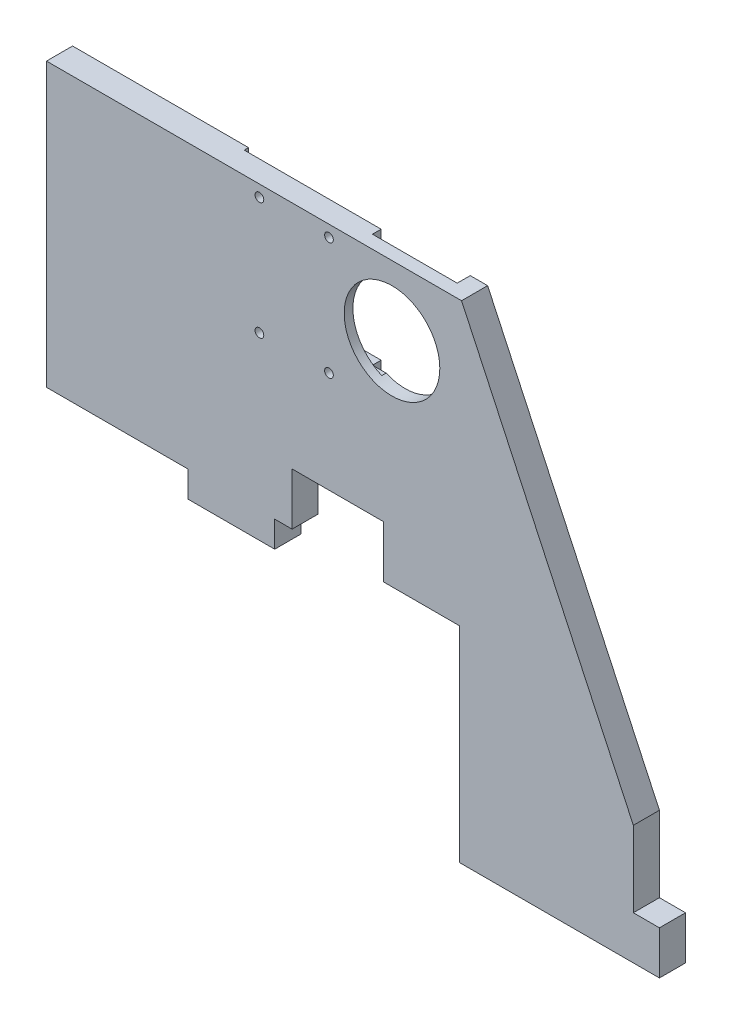
ISO-10303-21;
HEADER;
FILE_DESCRIPTION(('STEP AP214'),'2;1');
FILE_NAME('part.step','',(''),(''),'','','');
FILE_SCHEMA(('AUTOMOTIVE_DESIGN { 1 0 10303 214 1 1 1 1 }'));
ENDSEC;
DATA;
#1=APPLICATION_CONTEXT('core data for automotive mechanical design processes');
#2=APPLICATION_PROTOCOL_DEFINITION('international standard','automotive_design',2000,#1);
#3=PRODUCT_CONTEXT('',#1,'mechanical');
#4=PRODUCT('Part','Part','',(#3));
#5=PRODUCT_RELATED_PRODUCT_CATEGORY('part','',(#4));
#6=PRODUCT_DEFINITION_FORMATION('','',#4);
#7=PRODUCT_DEFINITION_CONTEXT('part definition',#1,'design');
#8=PRODUCT_DEFINITION('design','',#6,#7);
#9=PRODUCT_DEFINITION_SHAPE('','',#8);
#10=(LENGTH_UNIT() NAMED_UNIT(*) SI_UNIT(.MILLI.,.METRE.));
#11=(NAMED_UNIT(*) PLANE_ANGLE_UNIT() SI_UNIT($,.RADIAN.));
#12=(NAMED_UNIT(*) SI_UNIT($,.STERADIAN.) SOLID_ANGLE_UNIT());
#13=UNCERTAINTY_MEASURE_WITH_UNIT(LENGTH_MEASURE(1.E-05),#10,'distance_accuracy_value','');
#14=(GEOMETRIC_REPRESENTATION_CONTEXT(3) GLOBAL_UNCERTAINTY_ASSIGNED_CONTEXT((#13)) GLOBAL_UNIT_ASSIGNED_CONTEXT((#10,
#11,#12)) REPRESENTATION_CONTEXT('',''));
#15=CARTESIAN_POINT('',(0.,0.,0.));
#16=DIRECTION('',(0.,0.,1.));
#17=DIRECTION('',(1.,0.,0.));
#18=AXIS2_PLACEMENT_3D('',#15,#16,#17);
#19=CARTESIAN_POINT('',(0.,0.,6.));
#20=DIRECTION('',(0.,0.,1.));
#21=DIRECTION('',(1.,0.,0.));
#22=AXIS2_PLACEMENT_3D('',#19,#20,#21);
#23=PLANE('',#22);
#24=CARTESIAN_POINT('',(-18.5195740286363,26.435,6.));
#25=DIRECTION('',(0.,0.,1.));
#26=DIRECTION('',(1.,0.,0.));
#27=AXIS2_PLACEMENT_3D('',#24,#25,#26);
#28=CIRCLE('',#27,1.);
#29=CARTESIAN_POINT('',(-17.5195740286363,26.435,6.));
#30=VERTEX_POINT('',#29);
#31=EDGE_CURVE('E264',#30,#30,#28,.T.);
#32=ORIENTED_EDGE('',*,*,#31,.F.);
#33=EDGE_LOOP('',(#32));
#34=FACE_BOUND('',#33,.T.);
#35=CARTESIAN_POINT('',(-2.5195740286363,26.435,6.));
#36=DIRECTION('',(0.,0.,1.));
#37=DIRECTION('',(1.,0.,0.));
#38=AXIS2_PLACEMENT_3D('',#35,#36,#37);
#39=CIRCLE('',#38,1.);
#40=CARTESIAN_POINT('',(-1.5195740286363,26.435,6.));
#41=VERTEX_POINT('',#40);
#42=EDGE_CURVE('E270',#41,#41,#39,.T.);
#43=ORIENTED_EDGE('',*,*,#42,.F.);
#44=EDGE_LOOP('',(#43));
#45=FACE_BOUND('',#44,.T.);
#46=CARTESIAN_POINT('',(-18.5195740286363,53.435,6.));
#47=DIRECTION('',(0.,0.,1.));
#48=DIRECTION('',(1.,0.,0.));
#49=AXIS2_PLACEMENT_3D('',#46,#47,#48);
#50=CIRCLE('',#49,1.);
#51=CARTESIAN_POINT('',(-17.5195740286363,53.435,6.));
#52=VERTEX_POINT('',#51);
#53=EDGE_CURVE('E276',#52,#52,#50,.T.);
#54=ORIENTED_EDGE('',*,*,#53,.F.);
#55=EDGE_LOOP('',(#54));
#56=FACE_BOUND('',#55,.T.);
#57=CARTESIAN_POINT('',(-2.5195740286363,53.435,6.));
#58=DIRECTION('',(0.,0.,1.));
#59=DIRECTION('',(1.,0.,0.));
#60=AXIS2_PLACEMENT_3D('',#57,#58,#59);
#61=CIRCLE('',#60,1.);
#62=CARTESIAN_POINT('',(-1.5195740286363,53.435,6.));
#63=VERTEX_POINT('',#62);
#64=EDGE_CURVE('E282',#63,#63,#61,.T.);
#65=ORIENTED_EDGE('',*,*,#64,.F.);
#66=EDGE_LOOP('',(#65));
#67=FACE_BOUND('',#66,.T.);
#68=CARTESIAN_POINT('',(11.9804259713637,40.085,6.));
#69=DIRECTION('',(0.,0.,1.));
#70=DIRECTION('',(1.,0.,0.));
#71=AXIS2_PLACEMENT_3D('',#68,#69,#70);
#72=CIRCLE('',#71,11.);
#73=CARTESIAN_POINT('',(22.9804259713637,40.085,6.));
#74=VERTEX_POINT('',#73);
#75=EDGE_CURVE('E336',#74,#74,#72,.T.);
#76=ORIENTED_EDGE('',*,*,#75,.F.);
#77=EDGE_LOOP('',(#76));
#78=FACE_BOUND('',#77,.T.);
#79=DIRECTION('',(-1.,0.,0.));
#80=VECTOR('',#79,1.);
#81=CARTESIAN_POINT('',(-38.5,-8.91500000000001,6.));
#82=LINE('',#81,#80);
#83=CARTESIAN_POINT('',(-11.,-8.915,6.));
#84=VERTEX_POINT('',#83);
#85=CARTESIAN_POINT('',(-15.,-8.91500000000001,6.));
#86=VERTEX_POINT('',#85);
#87=EDGE_CURVE('E537',#84,#86,#82,.T.);
#88=ORIENTED_EDGE('',*,*,#87,.F.);
#89=DIRECTION('',(0.,1.,0.));
#90=VECTOR('',#89,1.);
#91=CARTESIAN_POINT('',(-11.,-8.915,6.));
#92=LINE('',#91,#90);
#93=CARTESIAN_POINT('',(-11.,3.085,6.));
#94=VERTEX_POINT('',#93);
#95=EDGE_CURVE('E247',#84,#94,#92,.T.);
#96=ORIENTED_EDGE('',*,*,#95,.T.);
#97=DIRECTION('',(1.,0.,0.));
#98=VECTOR('',#97,1.);
#99=CARTESIAN_POINT('',(-11.,3.085,6.));
#100=LINE('',#99,#98);
#101=CARTESIAN_POINT('',(10.,3.085,6.));
#102=VERTEX_POINT('',#101);
#103=EDGE_CURVE('E250',#94,#102,#100,.T.);
#104=ORIENTED_EDGE('',*,*,#103,.T.);
#105=DIRECTION('',(0.,1.,0.));
#106=VECTOR('',#105,1.);
#107=CARTESIAN_POINT('',(10.,-8.915,6.));
#108=LINE('',#107,#106);
#109=CARTESIAN_POINT('',(10.,-8.915,6.));
#110=VERTEX_POINT('',#109);
#111=EDGE_CURVE('E238',#110,#102,#108,.T.);
#112=ORIENTED_EDGE('',*,*,#111,.F.);
#113=CARTESIAN_POINT('',(27.5,-8.915,6.));
#114=VERTEX_POINT('',#113);
#115=EDGE_CURVE('E533',#114,#110,#82,.T.);
#116=ORIENTED_EDGE('',*,*,#115,.F.);
#117=DIRECTION('',(0.,1.,0.));
#118=VECTOR('',#117,1.);
#119=CARTESIAN_POINT('',(27.5,-56.085,6.));
#120=LINE('',#119,#118);
#121=CARTESIAN_POINT('',(27.5,-56.085,6.));
#122=VERTEX_POINT('',#121);
#123=EDGE_CURVE('E524',#122,#114,#120,.T.);
#124=ORIENTED_EDGE('',*,*,#123,.F.);
#125=DIRECTION('',(1.,0.,0.));
#126=VECTOR('',#125,1.);
#127=CARTESIAN_POINT('',(-67.5,-56.085,6.));
#128=LINE('',#127,#126);
#129=CARTESIAN_POINT('',(73.5,-56.085,6.));
#130=VERTEX_POINT('',#129);
#131=EDGE_CURVE('E499',#122,#130,#128,.T.);
#132=ORIENTED_EDGE('',*,*,#131,.T.);
#133=DIRECTION('',(0.,1.,0.));
#134=VECTOR('',#133,1.);
#135=CARTESIAN_POINT('',(73.5,-56.085,6.));
#136=LINE('',#135,#134);
#137=CARTESIAN_POINT('',(73.5,-46.085,6.));
#138=VERTEX_POINT('',#137);
#139=EDGE_CURVE('E386',#130,#138,#136,.T.);
#140=ORIENTED_EDGE('',*,*,#139,.T.);
#141=DIRECTION('',(-1.,0.,0.));
#142=VECTOR('',#141,1.);
#143=CARTESIAN_POINT('',(67.5,-46.085,6.));
#144=LINE('',#143,#142);
#145=CARTESIAN_POINT('',(67.5,-46.085,6.));
#146=VERTEX_POINT('',#145);
#147=EDGE_CURVE('E397',#138,#146,#144,.T.);
#148=ORIENTED_EDGE('',*,*,#147,.T.);
#149=DIRECTION('',(0.,1.,0.));
#150=VECTOR('',#149,1.);
#151=CARTESIAN_POINT('',(67.5,56.085,6.));
#152=LINE('',#151,#150);
#153=CARTESIAN_POINT('',(67.5,-28.665,6.));
#154=VERTEX_POINT('',#153);
#155=EDGE_CURVE('E410',#146,#154,#152,.T.);
#156=ORIENTED_EDGE('',*,*,#155,.T.);
#157=DIRECTION('',(0.422618261740701,-0.906307787036649,0.));
#158=VECTOR('',#157,1.);
#159=CARTESIAN_POINT('',(67.5,-28.665,6.));
#160=LINE('',#159,#158);
#161=CARTESIAN_POINT('',(27.9804259713637,56.085,6.));
#162=VERTEX_POINT('',#161);
#163=EDGE_CURVE('E409',#162,#154,#160,.T.);
#164=ORIENTED_EDGE('',*,*,#163,.F.);
#165=DIRECTION('',(-1.,0.,0.));
#166=VECTOR('',#165,1.);
#167=CARTESIAN_POINT('',(-67.5,56.085,6.));
#168=LINE('',#167,#166);
#169=CARTESIAN_POINT('',(-67.5,56.085,6.));
#170=VERTEX_POINT('',#169);
#171=EDGE_CURVE('E491',#162,#170,#168,.T.);
#172=ORIENTED_EDGE('',*,*,#171,.T.);
#173=DIRECTION('',(0.,-1.,0.));
#174=VECTOR('',#173,1.);
#175=CARTESIAN_POINT('',(-67.5,56.085,6.));
#176=LINE('',#175,#174);
#177=CARTESIAN_POINT('',(-67.5,-8.91500000000001,6.));
#178=VERTEX_POINT('',#177);
#179=EDGE_CURVE('E485',#170,#178,#176,.T.);
#180=ORIENTED_EDGE('',*,*,#179,.T.);
#181=CARTESIAN_POINT('',(-35.,-8.915,6.));
#182=VERTEX_POINT('',#181);
#183=EDGE_CURVE('E538',#182,#178,#82,.T.);
#184=ORIENTED_EDGE('',*,*,#183,.F.);
#185=DIRECTION('',(0.,-1.,0.));
#186=VECTOR('',#185,1.);
#187=CARTESIAN_POINT('',(-35.,-8.915,6.));
#188=LINE('',#187,#186);
#189=CARTESIAN_POINT('',(-35.,-14.915,6.));
#190=VERTEX_POINT('',#189);
#191=EDGE_CURVE('E358',#182,#190,#188,.T.);
#192=ORIENTED_EDGE('',*,*,#191,.T.);
#193=DIRECTION('',(1.,0.,0.));
#194=VECTOR('',#193,1.);
#195=CARTESIAN_POINT('',(-35.,-14.915,6.));
#196=LINE('',#195,#194);
#197=CARTESIAN_POINT('',(-15.,-14.915,6.));
#198=VERTEX_POINT('',#197);
#199=EDGE_CURVE('E378',#190,#198,#196,.T.);
#200=ORIENTED_EDGE('',*,*,#199,.T.);
#201=DIRECTION('',(0.,1.,0.));
#202=VECTOR('',#201,1.);
#203=CARTESIAN_POINT('',(-15.,-8.915,6.));
#204=LINE('',#203,#202);
#205=EDGE_CURVE('E369',#198,#86,#204,.T.);
#206=ORIENTED_EDGE('',*,*,#205,.T.);
#207=EDGE_LOOP('',(#88,#96,#104,#112,#116,#124,#132,#140,#148,#156,#164,#172,#180,#184,#192,
#200,#206));
#208=FACE_BOUND('',#207,.T.);
#209=ADVANCED_FACE('F33',(#34,#45,#56,#67,#78,#208),#23,.T.);
#210=CARTESIAN_POINT('',(0.,0.,0.));
#211=DIRECTION('',(0.,0.,1.));
#212=DIRECTION('',(1.,0.,0.));
#213=AXIS2_PLACEMENT_3D('',#210,#211,#212);
#214=PLANE('',#213);
#215=DIRECTION('',(0.,1.,0.));
#216=VECTOR('',#215,1.);
#217=CARTESIAN_POINT('',(-11.,-8.915,0.));
#218=LINE('',#217,#216);
#219=CARTESIAN_POINT('',(-11.,-8.915,0.));
#220=VERTEX_POINT('',#219);
#221=CARTESIAN_POINT('',(-11.,3.085,0.));
#222=VERTEX_POINT('',#221);
#223=EDGE_CURVE('E234',#220,#222,#218,.T.);
#224=ORIENTED_EDGE('',*,*,#223,.F.);
#225=DIRECTION('',(-1.,0.,0.));
#226=VECTOR('',#225,1.);
#227=CARTESIAN_POINT('',(-38.5,-8.91500000000001,0.));
#228=LINE('',#227,#226);
#229=CARTESIAN_POINT('',(-15.,-8.91500000000001,0.));
#230=VERTEX_POINT('',#229);
#231=EDGE_CURVE('E542',#220,#230,#228,.T.);
#232=ORIENTED_EDGE('',*,*,#231,.T.);
#233=DIRECTION('',(0.,1.,0.));
#234=VECTOR('',#233,1.);
#235=CARTESIAN_POINT('',(-15.,-8.915,0.));
#236=LINE('',#235,#234);
#237=CARTESIAN_POINT('',(-15.,-14.915,0.));
#238=VERTEX_POINT('',#237);
#239=EDGE_CURVE('E372',#238,#230,#236,.T.);
#240=ORIENTED_EDGE('',*,*,#239,.F.);
#241=DIRECTION('',(1.,0.,0.));
#242=VECTOR('',#241,1.);
#243=CARTESIAN_POINT('',(-35.,-14.915,0.));
#244=LINE('',#243,#242);
#245=CARTESIAN_POINT('',(-35.,-14.915,0.));
#246=VERTEX_POINT('',#245);
#247=EDGE_CURVE('E368',#246,#238,#244,.T.);
#248=ORIENTED_EDGE('',*,*,#247,.F.);
#249=DIRECTION('',(0.,-1.,0.));
#250=VECTOR('',#249,1.);
#251=CARTESIAN_POINT('',(-35.,-8.915,0.));
#252=LINE('',#251,#250);
#253=CARTESIAN_POINT('',(-35.,-8.91500000000001,0.));
#254=VERTEX_POINT('',#253);
#255=EDGE_CURVE('E365',#254,#246,#252,.T.);
#256=ORIENTED_EDGE('',*,*,#255,.F.);
#257=CARTESIAN_POINT('',(-67.5,-8.91500000000001,0.));
#258=VERTEX_POINT('',#257);
#259=EDGE_CURVE('E543',#254,#258,#228,.T.);
#260=ORIENTED_EDGE('',*,*,#259,.T.);
#261=DIRECTION('',(0.,-1.,0.));
#262=VECTOR('',#261,1.);
#263=CARTESIAN_POINT('',(-67.5,56.085,0.));
#264=LINE('',#263,#262);
#265=CARTESIAN_POINT('',(-67.5,56.085,0.));
#266=VERTEX_POINT('',#265);
#267=EDGE_CURVE('E482',#266,#258,#264,.T.);
#268=ORIENTED_EDGE('',*,*,#267,.F.);
#269=DIRECTION('',(-1.,0.,0.));
#270=VECTOR('',#269,1.);
#271=CARTESIAN_POINT('',(-67.5,56.085,0.));
#272=LINE('',#271,#270);
#273=CARTESIAN_POINT('',(-27.0195740286363,56.085,0.));
#274=VERTEX_POINT('',#273);
#275=EDGE_CURVE('E459',#274,#266,#272,.T.);
#276=ORIENTED_EDGE('',*,*,#275,.F.);
#277=DIRECTION('',(0.,1.,0.));
#278=VECTOR('',#277,1.);
#279=CARTESIAN_POINT('',(-27.0195740286363,56.085,0.));
#280=LINE('',#279,#278);
#281=CARTESIAN_POINT('',(-27.0195740286363,24.085,0.));
#282=VERTEX_POINT('',#281);
#283=EDGE_CURVE('E344',#282,#274,#280,.T.);
#284=ORIENTED_EDGE('',*,*,#283,.F.);
#285=DIRECTION('',(-1.,0.,0.));
#286=VECTOR('',#285,1.);
#287=CARTESIAN_POINT('',(23.9804259713637,24.085,0.));
#288=LINE('',#287,#286);
#289=CARTESIAN_POINT('',(23.9804259713637,24.085,0.));
#290=VERTEX_POINT('',#289);
#291=EDGE_CURVE('E351',#290,#282,#288,.T.);
#292=ORIENTED_EDGE('',*,*,#291,.F.);
#293=DIRECTION('',(0.,-1.,0.));
#294=VECTOR('',#293,1.);
#295=CARTESIAN_POINT('',(23.9804259713637,56.085,0.));
#296=LINE('',#295,#294);
#297=CARTESIAN_POINT('',(23.9804259713637,56.085,0.));
#298=VERTEX_POINT('',#297);
#299=EDGE_CURVE('E339',#298,#290,#296,.T.);
#300=ORIENTED_EDGE('',*,*,#299,.F.);
#301=CARTESIAN_POINT('',(27.9804259713637,56.085,0.));
#302=VERTEX_POINT('',#301);
#303=EDGE_CURVE('E474',#302,#298,#272,.T.);
#304=ORIENTED_EDGE('',*,*,#303,.F.);
#305=DIRECTION('',(0.422618261740701,-0.906307787036649,0.));
#306=VECTOR('',#305,1.);
#307=CARTESIAN_POINT('',(67.5,-28.665,0.));
#308=LINE('',#307,#306);
#309=CARTESIAN_POINT('',(67.5,-28.6649999999999,0.));
#310=VERTEX_POINT('',#309);
#311=EDGE_CURVE('E547',#302,#310,#308,.T.);
#312=ORIENTED_EDGE('',*,*,#311,.T.);
#313=DIRECTION('',(0.,1.,0.));
#314=VECTOR('',#313,1.);
#315=CARTESIAN_POINT('',(67.5,56.085,0.));
#316=LINE('',#315,#314);
#317=CARTESIAN_POINT('',(67.5,-46.085,0.));
#318=VERTEX_POINT('',#317);
#319=EDGE_CURVE('E483',#318,#310,#316,.T.);
#320=ORIENTED_EDGE('',*,*,#319,.F.);
#321=DIRECTION('',(-1.,0.,0.));
#322=VECTOR('',#321,1.);
#323=CARTESIAN_POINT('',(67.5,-46.085,0.));
#324=LINE('',#323,#322);
#325=CARTESIAN_POINT('',(73.5,-46.085,0.));
#326=VERTEX_POINT('',#325);
#327=EDGE_CURVE('E396',#326,#318,#324,.T.);
#328=ORIENTED_EDGE('',*,*,#327,.F.);
#329=DIRECTION('',(0.,1.,0.));
#330=VECTOR('',#329,1.);
#331=CARTESIAN_POINT('',(73.5,-56.085,0.));
#332=LINE('',#331,#330);
#333=CARTESIAN_POINT('',(73.5,-56.085,0.));
#334=VERTEX_POINT('',#333);
#335=EDGE_CURVE('E393',#334,#326,#332,.T.);
#336=ORIENTED_EDGE('',*,*,#335,.F.);
#337=DIRECTION('',(1.,0.,0.));
#338=VECTOR('',#337,1.);
#339=CARTESIAN_POINT('',(-67.5,-56.085,0.));
#340=LINE('',#339,#338);
#341=CARTESIAN_POINT('',(27.5,-56.085,0.));
#342=VERTEX_POINT('',#341);
#343=EDGE_CURVE('E486',#342,#334,#340,.T.);
#344=ORIENTED_EDGE('',*,*,#343,.F.);
#345=DIRECTION('',(0.,1.,0.));
#346=VECTOR('',#345,1.);
#347=CARTESIAN_POINT('',(27.5,-56.085,0.));
#348=LINE('',#347,#346);
#349=CARTESIAN_POINT('',(27.5,-8.915,0.));
#350=VERTEX_POINT('',#349);
#351=EDGE_CURVE('E536',#342,#350,#348,.T.);
#352=ORIENTED_EDGE('',*,*,#351,.T.);
#353=CARTESIAN_POINT('',(9.99999999999999,-8.915,0.));
#354=VERTEX_POINT('',#353);
#355=EDGE_CURVE('E246',#350,#354,#228,.T.);
#356=ORIENTED_EDGE('',*,*,#355,.T.);
#357=DIRECTION('',(0.,1.,0.));
#358=VECTOR('',#357,1.);
#359=CARTESIAN_POINT('',(10.,-8.915,0.));
#360=LINE('',#359,#358);
#361=CARTESIAN_POINT('',(10.,3.085,0.));
#362=VERTEX_POINT('',#361);
#363=EDGE_CURVE('E48',#354,#362,#360,.T.);
#364=ORIENTED_EDGE('',*,*,#363,.T.);
#365=DIRECTION('',(1.,0.,0.));
#366=VECTOR('',#365,1.);
#367=CARTESIAN_POINT('',(-11.,3.085,0.));
#368=LINE('',#367,#366);
#369=EDGE_CURVE('E226',#222,#362,#368,.T.);
#370=ORIENTED_EDGE('',*,*,#369,.F.);
#371=EDGE_LOOP('',(#224,#232,#240,#248,#256,#260,#268,#276,#284,#292,#300,#304,#312,#320,#328,
#336,#344,#352,#356,#364,#370));
#372=FACE_BOUND('',#371,.T.);
#373=ADVANCED_FACE('F243',(#372),#214,.F.);
#374=CARTESIAN_POINT('',(-38.5,-8.91500000000001,0.));
#375=DIRECTION('',(0.,1.,0.));
#376=DIRECTION('',(0.,0.,1.));
#377=AXIS2_PLACEMENT_3D('',#374,#375,#376);
#378=PLANE('',#377);
#379=DIRECTION('',(0.,0.,1.));
#380=VECTOR('',#379,1.);
#381=CARTESIAN_POINT('',(-11.,-8.915,0.));
#382=LINE('',#381,#380);
#383=EDGE_CURVE('E256',#220,#84,#382,.T.);
#384=ORIENTED_EDGE('',*,*,#383,.T.);
#385=ORIENTED_EDGE('',*,*,#87,.T.);
#386=DIRECTION('',(0.,0.,1.));
#387=VECTOR('',#386,1.);
#388=CARTESIAN_POINT('',(-15.,-8.915,0.));
#389=LINE('',#388,#387);
#390=EDGE_CURVE('E387',#230,#86,#389,.T.);
#391=ORIENTED_EDGE('',*,*,#390,.F.);
#392=ORIENTED_EDGE('',*,*,#231,.F.);
#393=EDGE_LOOP('',(#384,#385,#391,#392));
#394=FACE_BOUND('',#393,.T.);
#395=ADVANCED_FACE('F574',(#394),#378,.F.);
#396=CARTESIAN_POINT('',(0.,0.,3.));
#397=DIRECTION('',(0.,0.,-1.));
#398=DIRECTION('',(-1.,0.,0.));
#399=AXIS2_PLACEMENT_3D('',#396,#397,#398);
#400=PLANE('',#399);
#401=DIRECTION('',(-1.,0.,0.));
#402=VECTOR('',#401,1.);
#403=CARTESIAN_POINT('',(23.9804259713637,24.085,3.));
#404=LINE('',#403,#402);
#405=CARTESIAN_POINT('',(23.9804259713637,24.085,3.));
#406=VERTEX_POINT('',#405);
#407=CARTESIAN_POINT('',(4.4804259713637,24.085,3.));
#408=VERTEX_POINT('',#407);
#409=EDGE_CURVE('E343',#406,#408,#404,.T.);
#410=ORIENTED_EDGE('',*,*,#409,.T.);
#411=DIRECTION('',(0.,-1.,0.));
#412=VECTOR('',#411,1.);
#413=CARTESIAN_POINT('',(4.4804259713637,29.985,3.));
#414=LINE('',#413,#412);
#415=CARTESIAN_POINT('',(4.4804259713637,29.985,3.));
#416=VERTEX_POINT('',#415);
#417=EDGE_CURVE('E291',#416,#408,#414,.T.);
#418=ORIENTED_EDGE('',*,*,#417,.F.);
#419=DIRECTION('',(-1.,0.,0.));
#420=VECTOR('',#419,1.);
#421=CARTESIAN_POINT('',(9.4804259713637,29.985,3.));
#422=LINE('',#421,#420);
#423=CARTESIAN_POINT('',(7.62267425746351,29.985,3.));
#424=VERTEX_POINT('',#423);
#425=EDGE_CURVE('E317',#424,#416,#422,.T.);
#426=ORIENTED_EDGE('',*,*,#425,.F.);
#427=CARTESIAN_POINT('',(11.9804259713637,40.085,3.));
#428=DIRECTION('',(0.,0.,-1.));
#429=DIRECTION('',(-1.,0.,0.));
#430=AXIS2_PLACEMENT_3D('',#427,#428,#429);
#431=CIRCLE('',#430,11.);
#432=CARTESIAN_POINT('',(7.62267425746353,50.185,3.));
#433=VERTEX_POINT('',#432);
#434=EDGE_CURVE('E332',#433,#424,#431,.T.);
#435=ORIENTED_EDGE('',*,*,#434,.F.);
#436=DIRECTION('',(1.,0.,0.));
#437=VECTOR('',#436,1.);
#438=CARTESIAN_POINT('',(9.4804259713637,50.185,3.));
#439=LINE('',#438,#437);
#440=CARTESIAN_POINT('',(4.4804259713637,50.185,3.));
#441=VERTEX_POINT('',#440);
#442=EDGE_CURVE('E321',#441,#433,#439,.T.);
#443=ORIENTED_EDGE('',*,*,#442,.F.);
#444=DIRECTION('',(0.,-1.,0.));
#445=VECTOR('',#444,1.);
#446=CARTESIAN_POINT('',(4.4804259713637,56.085,3.));
#447=LINE('',#446,#445);
#448=CARTESIAN_POINT('',(4.4804259713637,56.085,3.));
#449=VERTEX_POINT('',#448);
#450=EDGE_CURVE('E56',#449,#441,#447,.T.);
#451=ORIENTED_EDGE('',*,*,#450,.F.);
#452=DIRECTION('',(1.,0.,0.));
#453=VECTOR('',#452,1.);
#454=CARTESIAN_POINT('',(23.9804259713637,56.085,3.));
#455=LINE('',#454,#453);
#456=CARTESIAN_POINT('',(23.9804259713637,56.085,3.));
#457=VERTEX_POINT('',#456);
#458=EDGE_CURVE('E347',#449,#457,#455,.T.);
#459=ORIENTED_EDGE('',*,*,#458,.T.);
#460=DIRECTION('',(0.,-1.,0.));
#461=VECTOR('',#460,1.);
#462=CARTESIAN_POINT('',(23.9804259713637,56.085,3.));
#463=LINE('',#462,#461);
#464=EDGE_CURVE('E340',#457,#406,#463,.T.);
#465=ORIENTED_EDGE('',*,*,#464,.T.);
#466=EDGE_LOOP('',(#410,#418,#426,#435,#443,#451,#459,#465));
#467=FACE_BOUND('',#466,.T.);
#468=ADVANCED_FACE('F437',(#467),#400,.T.);
#469=CARTESIAN_POINT('',(23.9804259713637,24.085,3.));
#470=DIRECTION('',(0.,-1.,0.));
#471=DIRECTION('',(0.,0.,-1.));
#472=AXIS2_PLACEMENT_3D('',#469,#470,#471);
#473=PLANE('',#472);
#474=DIRECTION('',(0.,0.,-1.));
#475=VECTOR('',#474,1.);
#476=CARTESIAN_POINT('',(-27.0195740286363,24.085,3.));
#477=LINE('',#476,#475);
#478=CARTESIAN_POINT('',(-27.0195740286363,24.085,1.));
#479=VERTEX_POINT('',#478);
#480=EDGE_CURVE('E361',#479,#282,#477,.T.);
#481=ORIENTED_EDGE('',*,*,#480,.F.);
#482=DIRECTION('',(-1.,0.,0.));
#483=VECTOR('',#482,1.);
#484=CARTESIAN_POINT('',(-20.5195740286363,24.085,1.));
#485=LINE('',#484,#483);
#486=CARTESIAN_POINT('',(4.4804259713637,24.085,1.));
#487=VERTEX_POINT('',#486);
#488=EDGE_CURVE('E296',#487,#479,#485,.T.);
#489=ORIENTED_EDGE('',*,*,#488,.F.);
#490=DIRECTION('',(0.,0.,1.));
#491=VECTOR('',#490,1.);
#492=CARTESIAN_POINT('',(4.4804259713637,24.085,1.));
#493=LINE('',#492,#491);
#494=EDGE_CURVE('E298',#487,#408,#493,.T.);
#495=ORIENTED_EDGE('',*,*,#494,.T.);
#496=ORIENTED_EDGE('',*,*,#409,.F.);
#497=DIRECTION('',(0.,0.,-1.));
#498=VECTOR('',#497,1.);
#499=CARTESIAN_POINT('',(23.9804259713637,24.085,3.));
#500=LINE('',#499,#498);
#501=EDGE_CURVE('E349',#406,#290,#500,.T.);
#502=ORIENTED_EDGE('',*,*,#501,.T.);
#503=ORIENTED_EDGE('',*,*,#291,.T.);
#504=EDGE_LOOP('',(#481,#489,#495,#496,#502,#503));
#505=FACE_BOUND('',#504,.T.);
#506=ADVANCED_FACE('F447',(#505),#473,.F.);
#507=ORIENTED_EDGE('',*,*,#259,.F.);
#508=DIRECTION('',(0.,0.,1.));
#509=VECTOR('',#508,1.);
#510=CARTESIAN_POINT('',(-35.,-8.915,0.));
#511=LINE('',#510,#509);
#512=EDGE_CURVE('E383',#254,#182,#511,.T.);
#513=ORIENTED_EDGE('',*,*,#512,.T.);
#514=ORIENTED_EDGE('',*,*,#183,.T.);
#515=DIRECTION('',(0.,0.,1.));
#516=VECTOR('',#515,1.);
#517=CARTESIAN_POINT('',(-67.5,-8.91500000000001,0.));
#518=LINE('',#517,#516);
#519=EDGE_CURVE('E529',#258,#178,#518,.T.);
#520=ORIENTED_EDGE('',*,*,#519,.F.);
#521=EDGE_LOOP('',(#507,#513,#514,#520));
#522=FACE_BOUND('',#521,.T.);
#523=ADVANCED_FACE('F559',(#522),#378,.F.);
#524=CARTESIAN_POINT('',(67.5,56.085,6.));
#525=DIRECTION('',(-1.,0.,0.));
#526=DIRECTION('',(0.,0.,1.));
#527=AXIS2_PLACEMENT_3D('',#524,#525,#526);
#528=PLANE('',#527);
#529=DIRECTION('',(0.,0.,1.));
#530=VECTOR('',#529,1.);
#531=CARTESIAN_POINT('',(67.5,-46.085,0.));
#532=LINE('',#531,#530);
#533=EDGE_CURVE('E405',#318,#146,#532,.T.);
#534=ORIENTED_EDGE('',*,*,#533,.F.);
#535=ORIENTED_EDGE('',*,*,#319,.T.);
#536=DIRECTION('',(0.,0.,1.));
#537=VECTOR('',#536,1.);
#538=CARTESIAN_POINT('',(67.5,-28.665,0.));
#539=LINE('',#538,#537);
#540=EDGE_CURVE('E540',#310,#154,#539,.T.);
#541=ORIENTED_EDGE('',*,*,#540,.T.);
#542=ORIENTED_EDGE('',*,*,#155,.F.);
#543=EDGE_LOOP('',(#534,#535,#541,#542));
#544=FACE_BOUND('',#543,.T.);
#545=ADVANCED_FACE('F601',(#544),#528,.F.);
#546=CARTESIAN_POINT('',(-67.5,56.085,6.));
#547=DIRECTION('',(1.,0.,0.));
#548=DIRECTION('',(0.,0.,-1.));
#549=AXIS2_PLACEMENT_3D('',#546,#547,#548);
#550=PLANE('',#549);
#551=ORIENTED_EDGE('',*,*,#267,.T.);
#552=ORIENTED_EDGE('',*,*,#519,.T.);
#553=ORIENTED_EDGE('',*,*,#179,.F.);
#554=DIRECTION('',(0.,0.,-1.));
#555=VECTOR('',#554,1.);
#556=CARTESIAN_POINT('',(-67.5,56.085,6.));
#557=LINE('',#556,#555);
#558=EDGE_CURVE('E423',#170,#266,#557,.T.);
#559=ORIENTED_EDGE('',*,*,#558,.T.);
#560=EDGE_LOOP('',(#551,#552,#553,#559));
#561=FACE_BOUND('',#560,.T.);
#562=ADVANCED_FACE('F35',(#561),#550,.F.);
#563=CARTESIAN_POINT('',(-67.5,-56.085,6.));
#564=DIRECTION('',(0.,1.,0.));
#565=DIRECTION('',(0.,0.,1.));
#566=AXIS2_PLACEMENT_3D('',#563,#564,#565);
#567=PLANE('',#566);
#568=ORIENTED_EDGE('',*,*,#131,.F.);
#569=DIRECTION('',(0.,0.,1.));
#570=VECTOR('',#569,1.);
#571=CARTESIAN_POINT('',(27.5,-56.085,0.));
#572=LINE('',#571,#570);
#573=EDGE_CURVE('E503',#342,#122,#572,.T.);
#574=ORIENTED_EDGE('',*,*,#573,.F.);
#575=ORIENTED_EDGE('',*,*,#343,.T.);
#576=DIRECTION('',(0.,0.,1.));
#577=VECTOR('',#576,1.);
#578=CARTESIAN_POINT('',(73.5,-56.085,0.));
#579=LINE('',#578,#577);
#580=EDGE_CURVE('E419',#334,#130,#579,.T.);
#581=ORIENTED_EDGE('',*,*,#580,.T.);
#582=EDGE_LOOP('',(#568,#574,#575,#581));
#583=FACE_BOUND('',#582,.T.);
#584=ADVANCED_FACE('F510',(#583),#567,.F.);
#585=CARTESIAN_POINT('',(-67.5,56.085,6.));
#586=DIRECTION('',(0.,-1.,0.));
#587=DIRECTION('',(0.,0.,-1.));
#588=AXIS2_PLACEMENT_3D('',#585,#586,#587);
#589=PLANE('',#588);
#590=DIRECTION('',(1.,0.,0.));
#591=VECTOR('',#590,1.);
#592=CARTESIAN_POINT('',(4.4804259713637,56.085,1.));
#593=LINE('',#592,#591);
#594=CARTESIAN_POINT('',(-27.0195740286363,56.085,1.));
#595=VERTEX_POINT('',#594);
#596=CARTESIAN_POINT('',(4.4804259713637,56.085,1.));
#597=VERTEX_POINT('',#596);
#598=EDGE_CURVE('E310',#595,#597,#593,.T.);
#599=ORIENTED_EDGE('',*,*,#598,.F.);
#600=DIRECTION('',(0.,0.,-1.));
#601=VECTOR('',#600,1.);
#602=CARTESIAN_POINT('',(-27.0195740286363,56.085,3.));
#603=LINE('',#602,#601);
#604=EDGE_CURVE('E359',#595,#274,#603,.T.);
#605=ORIENTED_EDGE('',*,*,#604,.T.);
#606=ORIENTED_EDGE('',*,*,#275,.T.);
#607=ORIENTED_EDGE('',*,*,#558,.F.);
#608=ORIENTED_EDGE('',*,*,#171,.F.);
#609=DIRECTION('',(0.,0.,1.));
#610=VECTOR('',#609,1.);
#611=CARTESIAN_POINT('',(27.9804259713637,56.085,0.));
#612=LINE('',#611,#610);
#613=EDGE_CURVE('E545',#302,#162,#612,.T.);
#614=ORIENTED_EDGE('',*,*,#613,.F.);
#615=ORIENTED_EDGE('',*,*,#303,.T.);
#616=DIRECTION('',(0.,0.,-1.));
#617=VECTOR('',#616,1.);
#618=CARTESIAN_POINT('',(23.9804259713637,56.085,3.));
#619=LINE('',#618,#617);
#620=EDGE_CURVE('E356',#457,#298,#619,.T.);
#621=ORIENTED_EDGE('',*,*,#620,.F.);
#622=ORIENTED_EDGE('',*,*,#458,.F.);
#623=DIRECTION('',(0.,0.,1.));
#624=VECTOR('',#623,1.);
#625=CARTESIAN_POINT('',(4.4804259713637,56.085,1.));
#626=LINE('',#625,#624);
#627=EDGE_CURVE('E312',#597,#449,#626,.T.);
#628=ORIENTED_EDGE('',*,*,#627,.F.);
#629=EDGE_LOOP('',(#599,#605,#606,#607,#608,#614,#615,#621,#622,#628));
#630=FACE_BOUND('',#629,.T.);
#631=ADVANCED_FACE('F457',(#630),#589,.F.);
#632=CARTESIAN_POINT('',(27.5,-56.085,0.));
#633=DIRECTION('',(1.,0.,0.));
#634=DIRECTION('',(0.,0.,-1.));
#635=AXIS2_PLACEMENT_3D('',#632,#633,#634);
#636=PLANE('',#635);
#637=ORIENTED_EDGE('',*,*,#123,.T.);
#638=DIRECTION('',(0.,0.,1.));
#639=VECTOR('',#638,1.);
#640=CARTESIAN_POINT('',(27.5,-8.915,0.));
#641=LINE('',#640,#639);
#642=EDGE_CURVE('E527',#350,#114,#641,.T.);
#643=ORIENTED_EDGE('',*,*,#642,.F.);
#644=ORIENTED_EDGE('',*,*,#351,.F.);
#645=ORIENTED_EDGE('',*,*,#573,.T.);
#646=EDGE_LOOP('',(#637,#643,#644,#645));
#647=FACE_BOUND('',#646,.T.);
#648=ADVANCED_FACE('F580',(#647),#636,.F.);
#649=ORIENTED_EDGE('',*,*,#115,.T.);
#650=DIRECTION('',(0.,0.,1.));
#651=VECTOR('',#650,1.);
#652=CARTESIAN_POINT('',(10.,-8.915,0.));
#653=LINE('',#652,#651);
#654=EDGE_CURVE('E240',#354,#110,#653,.T.);
#655=ORIENTED_EDGE('',*,*,#654,.F.);
#656=ORIENTED_EDGE('',*,*,#355,.F.);
#657=ORIENTED_EDGE('',*,*,#642,.T.);
#658=EDGE_LOOP('',(#649,#655,#656,#657));
#659=FACE_BOUND('',#658,.T.);
#660=ADVANCED_FACE('F578',(#659),#378,.F.);
#661=CARTESIAN_POINT('',(67.5,-28.665,0.));
#662=DIRECTION('',(-0.906307787036649,-0.422618261740701,0.));
#663=DIRECTION('',(0.422618261740701,-0.906307787036649,0.));
#664=AXIS2_PLACEMENT_3D('',#661,#662,#663);
#665=PLANE('',#664);
#666=ORIENTED_EDGE('',*,*,#163,.T.);
#667=ORIENTED_EDGE('',*,*,#540,.F.);
#668=ORIENTED_EDGE('',*,*,#311,.F.);
#669=ORIENTED_EDGE('',*,*,#613,.T.);
#670=EDGE_LOOP('',(#666,#667,#668,#669));
#671=FACE_BOUND('',#670,.T.);
#672=ADVANCED_FACE('F554',(#671),#665,.F.);
#673=CARTESIAN_POINT('',(67.5,-46.085,0.));
#674=DIRECTION('',(0.,1.,0.));
#675=DIRECTION('',(0.,0.,1.));
#676=AXIS2_PLACEMENT_3D('',#673,#674,#675);
#677=PLANE('',#676);
#678=ORIENTED_EDGE('',*,*,#147,.F.);
#679=DIRECTION('',(0.,0.,1.));
#680=VECTOR('',#679,1.);
#681=CARTESIAN_POINT('',(73.5,-46.085,0.));
#682=LINE('',#681,#680);
#683=EDGE_CURVE('E402',#326,#138,#682,.T.);
#684=ORIENTED_EDGE('',*,*,#683,.F.);
#685=ORIENTED_EDGE('',*,*,#327,.T.);
#686=ORIENTED_EDGE('',*,*,#533,.T.);
#687=EDGE_LOOP('',(#678,#684,#685,#686));
#688=FACE_BOUND('',#687,.T.);
#689=ADVANCED_FACE('F519',(#688),#677,.T.);
#690=CARTESIAN_POINT('',(73.5,-56.085,0.));
#691=DIRECTION('',(1.,0.,0.));
#692=DIRECTION('',(0.,0.,-1.));
#693=AXIS2_PLACEMENT_3D('',#690,#691,#692);
#694=PLANE('',#693);
#695=ORIENTED_EDGE('',*,*,#139,.F.);
#696=ORIENTED_EDGE('',*,*,#580,.F.);
#697=ORIENTED_EDGE('',*,*,#335,.T.);
#698=ORIENTED_EDGE('',*,*,#683,.T.);
#699=EDGE_LOOP('',(#695,#696,#697,#698));
#700=FACE_BOUND('',#699,.T.);
#701=ADVANCED_FACE('F514',(#700),#694,.T.);
#702=CARTESIAN_POINT('',(-35.,-8.915,0.));
#703=DIRECTION('',(-1.,0.,0.));
#704=DIRECTION('',(0.,0.,1.));
#705=AXIS2_PLACEMENT_3D('',#702,#703,#704);
#706=PLANE('',#705);
#707=ORIENTED_EDGE('',*,*,#191,.F.);
#708=ORIENTED_EDGE('',*,*,#512,.F.);
#709=ORIENTED_EDGE('',*,*,#255,.T.);
#710=DIRECTION('',(0.,0.,1.));
#711=VECTOR('',#710,1.);
#712=CARTESIAN_POINT('',(-35.,-14.915,0.));
#713=LINE('',#712,#711);
#714=EDGE_CURVE('E375',#246,#190,#713,.T.);
#715=ORIENTED_EDGE('',*,*,#714,.T.);
#716=EDGE_LOOP('',(#707,#708,#709,#715));
#717=FACE_BOUND('',#716,.T.);
#718=ADVANCED_FACE('F562',(#717),#706,.T.);
#719=CARTESIAN_POINT('',(-15.,-8.915,0.));
#720=DIRECTION('',(1.,0.,0.));
#721=DIRECTION('',(0.,1.,0.));
#722=AXIS2_PLACEMENT_3D('',#719,#720,#721);
#723=PLANE('',#722);
#724=ORIENTED_EDGE('',*,*,#205,.F.);
#725=DIRECTION('',(0.,0.,1.));
#726=VECTOR('',#725,1.);
#727=CARTESIAN_POINT('',(-15.,-14.915,0.));
#728=LINE('',#727,#726);
#729=EDGE_CURVE('E390',#238,#198,#728,.T.);
#730=ORIENTED_EDGE('',*,*,#729,.F.);
#731=ORIENTED_EDGE('',*,*,#239,.T.);
#732=ORIENTED_EDGE('',*,*,#390,.T.);
#733=EDGE_LOOP('',(#724,#730,#731,#732));
#734=FACE_BOUND('',#733,.T.);
#735=ADVANCED_FACE('F569',(#734),#723,.T.);
#736=CARTESIAN_POINT('',(-35.,-14.915,0.));
#737=DIRECTION('',(0.,-1.,0.));
#738=DIRECTION('',(0.,0.,-1.));
#739=AXIS2_PLACEMENT_3D('',#736,#737,#738);
#740=PLANE('',#739);
#741=ORIENTED_EDGE('',*,*,#199,.F.);
#742=ORIENTED_EDGE('',*,*,#714,.F.);
#743=ORIENTED_EDGE('',*,*,#247,.T.);
#744=ORIENTED_EDGE('',*,*,#729,.T.);
#745=EDGE_LOOP('',(#741,#742,#743,#744));
#746=FACE_BOUND('',#745,.T.);
#747=ADVANCED_FACE('F566',(#746),#740,.T.);
#748=CARTESIAN_POINT('',(23.9804259713637,56.085,3.));
#749=DIRECTION('',(1.,0.,0.));
#750=DIRECTION('',(0.,1.,0.));
#751=AXIS2_PLACEMENT_3D('',#748,#749,#750);
#752=PLANE('',#751);
#753=ORIENTED_EDGE('',*,*,#299,.T.);
#754=ORIENTED_EDGE('',*,*,#501,.F.);
#755=ORIENTED_EDGE('',*,*,#464,.F.);
#756=ORIENTED_EDGE('',*,*,#620,.T.);
#757=EDGE_LOOP('',(#753,#754,#755,#756));
#758=FACE_BOUND('',#757,.T.);
#759=ADVANCED_FACE('F477',(#758),#752,.F.);
#760=CARTESIAN_POINT('',(-27.0195740286363,56.085,3.));
#761=DIRECTION('',(-1.,0.,0.));
#762=DIRECTION('',(0.,-1.,0.));
#763=AXIS2_PLACEMENT_3D('',#760,#761,#762);
#764=PLANE('',#763);
#765=ORIENTED_EDGE('',*,*,#604,.F.);
#766=DIRECTION('',(0.,1.,0.));
#767=VECTOR('',#766,1.);
#768=CARTESIAN_POINT('',(-27.0195740286363,56.085,1.));
#769=LINE('',#768,#767);
#770=EDGE_CURVE('E288',#479,#595,#769,.T.);
#771=ORIENTED_EDGE('',*,*,#770,.F.);
#772=ORIENTED_EDGE('',*,*,#480,.T.);
#773=ORIENTED_EDGE('',*,*,#283,.T.);
#774=EDGE_LOOP('',(#765,#771,#772,#773));
#775=FACE_BOUND('',#774,.T.);
#776=ADVANCED_FACE('F453',(#775),#764,.F.);
#777=CARTESIAN_POINT('',(11.9804259713637,40.085,6.00005));
#778=DIRECTION('',(0.,0.,-1.));
#779=DIRECTION('',(-1.,0.,0.));
#780=AXIS2_PLACEMENT_3D('',#777,#778,#779);
#781=CYLINDRICAL_SURFACE('',#780,11.);
#782=ORIENTED_EDGE('',*,*,#75,.T.);
#783=EDGE_LOOP('',(#782));
#784=FACE_BOUND('',#783,.T.);
#785=CARTESIAN_POINT('',(11.9804259713637,40.085,4.));
#786=DIRECTION('',(0.,0.,-1.));
#787=DIRECTION('',(-1.,0.,0.));
#788=AXIS2_PLACEMENT_3D('',#785,#786,#787);
#789=CIRCLE('',#788,11.);
#790=CARTESIAN_POINT('',(7.62267425746353,50.185,4.));
#791=VERTEX_POINT('',#790);
#792=CARTESIAN_POINT('',(7.62267425746351,29.985,4.));
#793=VERTEX_POINT('',#792);
#794=EDGE_CURVE('E422',#791,#793,#789,.F.);
#795=ORIENTED_EDGE('',*,*,#794,.F.);
#796=DIRECTION('',(0.,0.,-1.));
#797=VECTOR('',#796,1.);
#798=CARTESIAN_POINT('',(7.62267425746353,50.185,6.00005));
#799=LINE('',#798,#797);
#800=EDGE_CURVE('E11',#791,#433,#799,.T.);
#801=ORIENTED_EDGE('',*,*,#800,.T.);
#802=ORIENTED_EDGE('',*,*,#434,.T.);
#803=DIRECTION('',(0.,0.,-1.));
#804=VECTOR('',#803,1.);
#805=CARTESIAN_POINT('',(7.62267425746351,29.985,6.00005));
#806=LINE('',#805,#804);
#807=EDGE_CURVE('E41',#424,#793,#806,.F.);
#808=ORIENTED_EDGE('',*,*,#807,.T.);
#809=EDGE_LOOP('',(#795,#801,#802,#808));
#810=FACE_BOUND('',#809,.T.);
#811=ADVANCED_FACE('F427',(#784,#810),#781,.F.);
#812=CARTESIAN_POINT('',(9.4804259713637,50.185,4.));
#813=DIRECTION('',(0.,1.,0.));
#814=DIRECTION('',(0.,0.,1.));
#815=AXIS2_PLACEMENT_3D('',#812,#813,#814);
#816=PLANE('',#815);
#817=DIRECTION('',(1.,0.,0.));
#818=VECTOR('',#817,1.);
#819=CARTESIAN_POINT('',(9.4804259713637,50.185,4.));
#820=LINE('',#819,#818);
#821=CARTESIAN_POINT('',(-20.5195740286363,50.185,4.));
#822=VERTEX_POINT('',#821);
#823=EDGE_CURVE('E324',#822,#791,#820,.T.);
#824=ORIENTED_EDGE('',*,*,#823,.F.);
#825=DIRECTION('',(0.,0.,-1.));
#826=VECTOR('',#825,1.);
#827=CARTESIAN_POINT('',(-20.5195740286363,50.185,4.));
#828=LINE('',#827,#826);
#829=CARTESIAN_POINT('',(-20.5195740286363,50.185,1.));
#830=VERTEX_POINT('',#829);
#831=EDGE_CURVE('E330',#822,#830,#828,.T.);
#832=ORIENTED_EDGE('',*,*,#831,.T.);
#833=DIRECTION('',(-1.,0.,0.));
#834=VECTOR('',#833,1.);
#835=CARTESIAN_POINT('',(4.4804259713637,50.185,1.));
#836=LINE('',#835,#834);
#837=CARTESIAN_POINT('',(4.4804259713637,50.185,1.));
#838=VERTEX_POINT('',#837);
#839=EDGE_CURVE('E307',#838,#830,#836,.T.);
#840=ORIENTED_EDGE('',*,*,#839,.F.);
#841=DIRECTION('',(0.,0.,1.));
#842=VECTOR('',#841,1.);
#843=CARTESIAN_POINT('',(4.4804259713637,50.185,1.));
#844=LINE('',#843,#842);
#845=EDGE_CURVE('E315',#838,#441,#844,.T.);
#846=ORIENTED_EDGE('',*,*,#845,.T.);
#847=ORIENTED_EDGE('',*,*,#442,.T.);
#848=ORIENTED_EDGE('',*,*,#800,.F.);
#849=EDGE_LOOP('',(#824,#832,#840,#846,#847,#848));
#850=FACE_BOUND('',#849,.T.);
#851=ADVANCED_FACE('F467',(#850),#816,.F.);
#852=CARTESIAN_POINT('',(9.4804259713637,29.985,4.));
#853=DIRECTION('',(0.,-1.,0.));
#854=DIRECTION('',(0.,0.,-1.));
#855=AXIS2_PLACEMENT_3D('',#852,#853,#854);
#856=PLANE('',#855);
#857=ORIENTED_EDGE('',*,*,#425,.T.);
#858=DIRECTION('',(0.,0.,1.));
#859=VECTOR('',#858,1.);
#860=CARTESIAN_POINT('',(4.4804259713637,29.985,1.));
#861=LINE('',#860,#859);
#862=CARTESIAN_POINT('',(4.4804259713637,29.985,1.));
#863=VERTEX_POINT('',#862);
#864=EDGE_CURVE('E302',#863,#416,#861,.T.);
#865=ORIENTED_EDGE('',*,*,#864,.F.);
#866=DIRECTION('',(1.,0.,0.));
#867=VECTOR('',#866,1.);
#868=CARTESIAN_POINT('',(-20.5195740286363,29.985,1.));
#869=LINE('',#868,#867);
#870=CARTESIAN_POINT('',(-20.5195740286363,29.985,1.));
#871=VERTEX_POINT('',#870);
#872=EDGE_CURVE('E292',#871,#863,#869,.T.);
#873=ORIENTED_EDGE('',*,*,#872,.F.);
#874=DIRECTION('',(0.,0.,-1.));
#875=VECTOR('',#874,1.);
#876=CARTESIAN_POINT('',(-20.5195740286363,29.985,4.));
#877=LINE('',#876,#875);
#878=CARTESIAN_POINT('',(-20.5195740286363,29.985,4.));
#879=VERTEX_POINT('',#878);
#880=EDGE_CURVE('E326',#879,#871,#877,.T.);
#881=ORIENTED_EDGE('',*,*,#880,.F.);
#882=DIRECTION('',(-1.,0.,0.));
#883=VECTOR('',#882,1.);
#884=CARTESIAN_POINT('',(9.4804259713637,29.985,4.));
#885=LINE('',#884,#883);
#886=EDGE_CURVE('E318',#793,#879,#885,.T.);
#887=ORIENTED_EDGE('',*,*,#886,.F.);
#888=ORIENTED_EDGE('',*,*,#807,.F.);
#889=EDGE_LOOP('',(#857,#865,#873,#881,#887,#888));
#890=FACE_BOUND('',#889,.T.);
#891=ADVANCED_FACE('F432',(#890),#856,.F.);
#892=CARTESIAN_POINT('',(0.,0.,4.));
#893=DIRECTION('',(0.,0.,-1.));
#894=DIRECTION('',(-1.,0.,0.));
#895=AXIS2_PLACEMENT_3D('',#892,#893,#894);
#896=PLANE('',#895);
#897=ORIENTED_EDGE('',*,*,#794,.T.);
#898=ORIENTED_EDGE('',*,*,#886,.T.);
#899=DIRECTION('',(0.,1.,0.));
#900=VECTOR('',#899,1.);
#901=CARTESIAN_POINT('',(-20.5195740286363,50.185,4.));
#902=LINE('',#901,#900);
#903=EDGE_CURVE('E320',#879,#822,#902,.T.);
#904=ORIENTED_EDGE('',*,*,#903,.T.);
#905=ORIENTED_EDGE('',*,*,#823,.T.);
#906=EDGE_LOOP('',(#897,#898,#904,#905));
#907=FACE_BOUND('',#906,.T.);
#908=ADVANCED_FACE('F740',(#907),#896,.T.);
#909=CARTESIAN_POINT('',(-20.5195740286363,50.185,4.));
#910=DIRECTION('',(-1.,0.,0.));
#911=DIRECTION('',(0.,-1.,0.));
#912=AXIS2_PLACEMENT_3D('',#909,#910,#911);
#913=PLANE('',#912);
#914=ORIENTED_EDGE('',*,*,#880,.T.);
#915=DIRECTION('',(0.,-1.,0.));
#916=VECTOR('',#915,1.);
#917=CARTESIAN_POINT('',(-20.5195740286363,56.085,1.));
#918=LINE('',#917,#916);
#919=EDGE_CURVE('E285',#830,#871,#918,.T.);
#920=ORIENTED_EDGE('',*,*,#919,.F.);
#921=ORIENTED_EDGE('',*,*,#831,.F.);
#922=ORIENTED_EDGE('',*,*,#903,.F.);
#923=EDGE_LOOP('',(#914,#920,#921,#922));
#924=FACE_BOUND('',#923,.T.);
#925=ADVANCED_FACE('F739',(#924),#913,.F.);
#926=CARTESIAN_POINT('',(4.4804259713637,56.085,1.));
#927=DIRECTION('',(-1.,0.,0.));
#928=DIRECTION('',(0.,-1.,0.));
#929=AXIS2_PLACEMENT_3D('',#926,#927,#928);
#930=PLANE('',#929);
#931=ORIENTED_EDGE('',*,*,#450,.T.);
#932=ORIENTED_EDGE('',*,*,#845,.F.);
#933=DIRECTION('',(0.,-1.,0.));
#934=VECTOR('',#933,1.);
#935=CARTESIAN_POINT('',(4.4804259713637,56.085,1.));
#936=LINE('',#935,#934);
#937=EDGE_CURVE('E304',#597,#838,#936,.T.);
#938=ORIENTED_EDGE('',*,*,#937,.F.);
#939=ORIENTED_EDGE('',*,*,#627,.T.);
#940=EDGE_LOOP('',(#931,#932,#938,#939));
#941=FACE_BOUND('',#940,.T.);
#942=ADVANCED_FACE('F464',(#941),#930,.F.);
#943=CARTESIAN_POINT('',(0.,0.,1.));
#944=DIRECTION('',(0.,0.,-1.));
#945=DIRECTION('',(-1.,0.,0.));
#946=AXIS2_PLACEMENT_3D('',#943,#944,#945);
#947=PLANE('',#946);
#948=CARTESIAN_POINT('',(-18.5195740286363,26.435,1.));
#949=DIRECTION('',(0.,0.,-1.));
#950=DIRECTION('',(-1.,0.,0.));
#951=AXIS2_PLACEMENT_3D('',#948,#949,#950);
#952=CIRCLE('',#951,1.);
#953=CARTESIAN_POINT('',(-19.5195740286363,26.435,1.));
#954=VERTEX_POINT('',#953);
#955=EDGE_CURVE('E259',#954,#954,#952,.T.);
#956=ORIENTED_EDGE('',*,*,#955,.F.);
#957=EDGE_LOOP('',(#956));
#958=FACE_BOUND('',#957,.T.);
#959=CARTESIAN_POINT('',(-2.5195740286363,26.435,1.));
#960=DIRECTION('',(0.,0.,-1.));
#961=DIRECTION('',(-1.,0.,0.));
#962=AXIS2_PLACEMENT_3D('',#959,#960,#961);
#963=CIRCLE('',#962,1.);
#964=CARTESIAN_POINT('',(-3.5195740286363,26.435,1.));
#965=VERTEX_POINT('',#964);
#966=EDGE_CURVE('E267',#965,#965,#963,.T.);
#967=ORIENTED_EDGE('',*,*,#966,.F.);
#968=EDGE_LOOP('',(#967));
#969=FACE_BOUND('',#968,.T.);
#970=CARTESIAN_POINT('',(-18.5195740286363,53.435,1.));
#971=DIRECTION('',(0.,0.,-1.));
#972=DIRECTION('',(-1.,0.,0.));
#973=AXIS2_PLACEMENT_3D('',#970,#971,#972);
#974=CIRCLE('',#973,1.);
#975=CARTESIAN_POINT('',(-19.5195740286363,53.435,1.));
#976=VERTEX_POINT('',#975);
#977=EDGE_CURVE('E273',#976,#976,#974,.T.);
#978=ORIENTED_EDGE('',*,*,#977,.F.);
#979=EDGE_LOOP('',(#978));
#980=FACE_BOUND('',#979,.T.);
#981=CARTESIAN_POINT('',(-2.5195740286363,53.435,1.));
#982=DIRECTION('',(0.,0.,-1.));
#983=DIRECTION('',(-1.,0.,0.));
#984=AXIS2_PLACEMENT_3D('',#981,#982,#983);
#985=CIRCLE('',#984,1.);
#986=CARTESIAN_POINT('',(-3.5195740286363,53.435,1.));
#987=VERTEX_POINT('',#986);
#988=EDGE_CURVE('E279',#987,#987,#985,.T.);
#989=ORIENTED_EDGE('',*,*,#988,.F.);
#990=EDGE_LOOP('',(#989));
#991=FACE_BOUND('',#990,.T.);
#992=ORIENTED_EDGE('',*,*,#937,.T.);
#993=ORIENTED_EDGE('',*,*,#839,.T.);
#994=ORIENTED_EDGE('',*,*,#919,.T.);
#995=ORIENTED_EDGE('',*,*,#872,.T.);
#996=DIRECTION('',(0.,-1.,0.));
#997=VECTOR('',#996,1.);
#998=CARTESIAN_POINT('',(4.4804259713637,29.985,1.));
#999=LINE('',#998,#997);
#1000=EDGE_CURVE('E294',#863,#487,#999,.T.);
#1001=ORIENTED_EDGE('',*,*,#1000,.T.);
#1002=ORIENTED_EDGE('',*,*,#488,.T.);
#1003=ORIENTED_EDGE('',*,*,#770,.T.);
#1004=ORIENTED_EDGE('',*,*,#598,.T.);
#1005=EDGE_LOOP('',(#992,#993,#994,#995,#1001,#1002,#1003,#1004));
#1006=FACE_BOUND('',#1005,.T.);
#1007=ADVANCED_FACE('F450',(#958,#969,#980,#991,#1006),#947,.T.);
#1008=CARTESIAN_POINT('',(4.4804259713637,29.985,1.));
#1009=DIRECTION('',(-1.,0.,0.));
#1010=DIRECTION('',(0.,0.,1.));
#1011=AXIS2_PLACEMENT_3D('',#1008,#1009,#1010);
#1012=PLANE('',#1011);
#1013=ORIENTED_EDGE('',*,*,#417,.T.);
#1014=ORIENTED_EDGE('',*,*,#494,.F.);
#1015=ORIENTED_EDGE('',*,*,#1000,.F.);
#1016=ORIENTED_EDGE('',*,*,#864,.T.);
#1017=EDGE_LOOP('',(#1013,#1014,#1015,#1016));
#1018=FACE_BOUND('',#1017,.T.);
#1019=ADVANCED_FACE('F442',(#1018),#1012,.F.);
#1020=CARTESIAN_POINT('',(-2.5195740286363,53.435,6.00005));
#1021=DIRECTION('',(0.,0.,-1.));
#1022=DIRECTION('',(-1.,0.,0.));
#1023=AXIS2_PLACEMENT_3D('',#1020,#1021,#1022);
#1024=CYLINDRICAL_SURFACE('',#1023,1.);
#1025=ORIENTED_EDGE('',*,*,#64,.T.);
#1026=EDGE_LOOP('',(#1025));
#1027=FACE_BOUND('',#1026,.T.);
#1028=ORIENTED_EDGE('',*,*,#988,.T.);
#1029=EDGE_LOOP('',(#1028));
#1030=FACE_BOUND('',#1029,.T.);
#1031=ADVANCED_FACE('F647',(#1027,#1030),#1024,.F.);
#1032=CARTESIAN_POINT('',(-18.5195740286363,53.435,6.00005));
#1033=DIRECTION('',(0.,0.,-1.));
#1034=DIRECTION('',(-1.,0.,0.));
#1035=AXIS2_PLACEMENT_3D('',#1032,#1033,#1034);
#1036=CYLINDRICAL_SURFACE('',#1035,1.);
#1037=ORIENTED_EDGE('',*,*,#53,.T.);
#1038=EDGE_LOOP('',(#1037));
#1039=FACE_BOUND('',#1038,.T.);
#1040=ORIENTED_EDGE('',*,*,#977,.T.);
#1041=EDGE_LOOP('',(#1040));
#1042=FACE_BOUND('',#1041,.T.);
#1043=ADVANCED_FACE('F660',(#1039,#1042),#1036,.F.);
#1044=CARTESIAN_POINT('',(-2.5195740286363,26.435,6.00005));
#1045=DIRECTION('',(0.,0.,-1.));
#1046=DIRECTION('',(-1.,0.,0.));
#1047=AXIS2_PLACEMENT_3D('',#1044,#1045,#1046);
#1048=CYLINDRICAL_SURFACE('',#1047,1.);
#1049=ORIENTED_EDGE('',*,*,#42,.T.);
#1050=EDGE_LOOP('',(#1049));
#1051=FACE_BOUND('',#1050,.T.);
#1052=ORIENTED_EDGE('',*,*,#966,.T.);
#1053=EDGE_LOOP('',(#1052));
#1054=FACE_BOUND('',#1053,.T.);
#1055=ADVANCED_FACE('F668',(#1051,#1054),#1048,.F.);
#1056=CARTESIAN_POINT('',(-18.5195740286363,26.435,6.00005));
#1057=DIRECTION('',(0.,0.,-1.));
#1058=DIRECTION('',(-1.,0.,0.));
#1059=AXIS2_PLACEMENT_3D('',#1056,#1057,#1058);
#1060=CYLINDRICAL_SURFACE('',#1059,1.);
#1061=ORIENTED_EDGE('',*,*,#31,.T.);
#1062=EDGE_LOOP('',(#1061));
#1063=FACE_BOUND('',#1062,.T.);
#1064=ORIENTED_EDGE('',*,*,#955,.T.);
#1065=EDGE_LOOP('',(#1064));
#1066=FACE_BOUND('',#1065,.T.);
#1067=ADVANCED_FACE('F676',(#1063,#1066),#1060,.F.);
#1068=CARTESIAN_POINT('',(-11.,-8.915,0.));
#1069=DIRECTION('',(1.,0.,0.));
#1070=DIRECTION('',(0.,0.,-1.));
#1071=AXIS2_PLACEMENT_3D('',#1068,#1069,#1070);
#1072=PLANE('',#1071);
#1073=ORIENTED_EDGE('',*,*,#95,.F.);
#1074=ORIENTED_EDGE('',*,*,#383,.F.);
#1075=ORIENTED_EDGE('',*,*,#223,.T.);
#1076=DIRECTION('',(0.,0.,1.));
#1077=VECTOR('',#1076,1.);
#1078=CARTESIAN_POINT('',(-11.,3.085,0.));
#1079=LINE('',#1078,#1077);
#1080=EDGE_CURVE('E231',#222,#94,#1079,.T.);
#1081=ORIENTED_EDGE('',*,*,#1080,.T.);
#1082=EDGE_LOOP('',(#1073,#1074,#1075,#1081));
#1083=FACE_BOUND('',#1082,.T.);
#1084=ADVANCED_FACE('F576',(#1083),#1072,.T.);
#1085=CARTESIAN_POINT('',(-11.,3.085,0.));
#1086=DIRECTION('',(0.,-1.,0.));
#1087=DIRECTION('',(0.,0.,-1.));
#1088=AXIS2_PLACEMENT_3D('',#1085,#1086,#1087);
#1089=PLANE('',#1088);
#1090=ORIENTED_EDGE('',*,*,#103,.F.);
#1091=ORIENTED_EDGE('',*,*,#1080,.F.);
#1092=ORIENTED_EDGE('',*,*,#369,.T.);
#1093=DIRECTION('',(0.,0.,1.));
#1094=VECTOR('',#1093,1.);
#1095=CARTESIAN_POINT('',(10.,3.085,0.));
#1096=LINE('',#1095,#1094);
#1097=EDGE_CURVE('E229',#362,#102,#1096,.T.);
#1098=ORIENTED_EDGE('',*,*,#1097,.T.);
#1099=EDGE_LOOP('',(#1090,#1091,#1092,#1098));
#1100=FACE_BOUND('',#1099,.T.);
#1101=ADVANCED_FACE('F228',(#1100),#1089,.T.);
#1102=CARTESIAN_POINT('',(10.,-8.915,0.));
#1103=DIRECTION('',(1.,0.,0.));
#1104=DIRECTION('',(0.,0.,-1.));
#1105=AXIS2_PLACEMENT_3D('',#1102,#1103,#1104);
#1106=PLANE('',#1105);
#1107=ORIENTED_EDGE('',*,*,#111,.T.);
#1108=ORIENTED_EDGE('',*,*,#1097,.F.);
#1109=ORIENTED_EDGE('',*,*,#363,.F.);
#1110=ORIENTED_EDGE('',*,*,#654,.T.);
#1111=EDGE_LOOP('',(#1107,#1108,#1109,#1110));
#1112=FACE_BOUND('',#1111,.T.);
#1113=ADVANCED_FACE('F236',(#1112),#1106,.F.);
#1114=CLOSED_SHELL('',(#209,#373,#395,#468,#506,#523,#545,#562,#584,#631,#648,#660,#672,#689,
#701,#718,#735,#747,#759,#776,#811,#851,#891,#908,#925,#942,#1007,#1019,#1031,#1043,#1055,#1067,
#1084,#1101,#1113));
#1115=MANIFOLD_SOLID_BREP('B2',#1114);
#1116=ADVANCED_BREP_SHAPE_REPRESENTATION('',(#18,#1115),#14);
#1117=SHAPE_DEFINITION_REPRESENTATION(#9,#1116);
ENDSEC;
END-ISO-10303-21;
